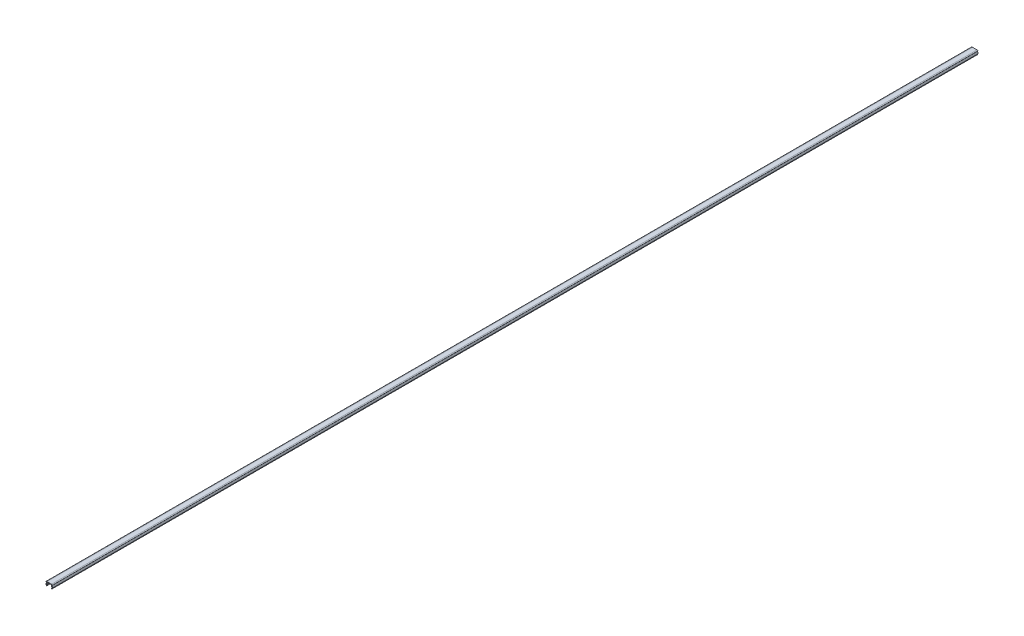
ISO-10303-21;
HEADER;
FILE_DESCRIPTION(('STEP AP214'),'2;1');
FILE_NAME('part.step','',(''),(''),'','','');
FILE_SCHEMA(('AUTOMOTIVE_DESIGN { 1 0 10303 214 1 1 1 1 }'));
ENDSEC;
DATA;
#1=APPLICATION_CONTEXT('core data for automotive mechanical design processes');
#2=APPLICATION_PROTOCOL_DEFINITION('international standard','automotive_design',2000,#1);
#3=PRODUCT_CONTEXT('',#1,'mechanical');
#4=PRODUCT('Part','Part','',(#3));
#5=PRODUCT_RELATED_PRODUCT_CATEGORY('part','',(#4));
#6=PRODUCT_DEFINITION_FORMATION('','',#4);
#7=PRODUCT_DEFINITION_CONTEXT('part definition',#1,'design');
#8=PRODUCT_DEFINITION('design','',#6,#7);
#9=PRODUCT_DEFINITION_SHAPE('','',#8);
#10=(LENGTH_UNIT() NAMED_UNIT(*) SI_UNIT(.MILLI.,.METRE.));
#11=(NAMED_UNIT(*) PLANE_ANGLE_UNIT() SI_UNIT($,.RADIAN.));
#12=(NAMED_UNIT(*) SI_UNIT($,.STERADIAN.) SOLID_ANGLE_UNIT());
#13=UNCERTAINTY_MEASURE_WITH_UNIT(LENGTH_MEASURE(1.E-05),#10,'distance_accuracy_value','');
#14=(GEOMETRIC_REPRESENTATION_CONTEXT(3) GLOBAL_UNCERTAINTY_ASSIGNED_CONTEXT((#13)) GLOBAL_UNIT_ASSIGNED_CONTEXT((#10,
#11,#12)) REPRESENTATION_CONTEXT('',''));
#15=CARTESIAN_POINT('',(0.,0.,0.));
#16=DIRECTION('',(0.,0.,1.));
#17=DIRECTION('',(1.,0.,0.));
#18=AXIS2_PLACEMENT_3D('',#15,#16,#17);
#19=CARTESIAN_POINT('',(0.,4.3,1000.));
#20=DIRECTION('',(0.,-1.,0.));
#21=DIRECTION('',(1.,0.,0.));
#22=AXIS2_PLACEMENT_3D('',#19,#20,#21);
#23=PLANE('',#22);
#24=DIRECTION('',(-1.,0.,0.));
#25=VECTOR('',#24,1.);
#26=CARTESIAN_POINT('',(0.,4.3,1000.));
#27=LINE('',#26,#25);
#28=CARTESIAN_POINT('',(2.5,4.3,1000.));
#29=VERTEX_POINT('',#28);
#30=CARTESIAN_POINT('',(-2.5,4.3,1000.));
#31=VERTEX_POINT('',#30);
#32=EDGE_CURVE('E242',#29,#31,#27,.T.);
#33=ORIENTED_EDGE('',*,*,#32,.F.);
#34=CARTESIAN_POINT('',(2.5,4.3,-50.));
#35=CARTESIAN_POINT('',(2.5,4.3,316.666666666667));
#36=CARTESIAN_POINT('',(2.5,4.3,683.333333333333));
#37=CARTESIAN_POINT('',(2.5,4.3,1050.));
#38=(BOUNDED_CURVE() B_SPLINE_CURVE(3,(#34,#35,#36,#37),.UNSPECIFIED.,.F.,
.F.) B_SPLINE_CURVE_WITH_KNOTS((4,4),(-1.05,0.05),
.UNSPECIFIED.) CURVE() GEOMETRIC_REPRESENTATION_ITEM() RATIONAL_B_SPLINE_CURVE((1.,1.,1.,1.)) REPRESENTATION_ITEM(''));
#39=CARTESIAN_POINT('',(2.5,4.3,0.));
#40=VERTEX_POINT('',#39);
#41=EDGE_CURVE('E249',#29,#40,#38,.F.);
#42=ORIENTED_EDGE('',*,*,#41,.T.);
#43=DIRECTION('',(-1.,0.,0.));
#44=VECTOR('',#43,1.);
#45=CARTESIAN_POINT('',(0.,4.3,0.));
#46=LINE('',#45,#44);
#47=CARTESIAN_POINT('',(-2.5,4.3,0.));
#48=VERTEX_POINT('',#47);
#49=EDGE_CURVE('E196',#40,#48,#46,.T.);
#50=ORIENTED_EDGE('',*,*,#49,.T.);
#51=CARTESIAN_POINT('',(-2.5,4.3,1050.));
#52=CARTESIAN_POINT('',(-2.5,4.3,683.333333333334));
#53=CARTESIAN_POINT('',(-2.5,4.3,316.666666666666));
#54=CARTESIAN_POINT('',(-2.5,4.3,-49.9999999999998));
#55=(BOUNDED_CURVE() B_SPLINE_CURVE(3,(#51,#52,#53,#54),.UNSPECIFIED.,.F.,
.F.) B_SPLINE_CURVE_WITH_KNOTS((4,4),(-0.05,1.05),
.UNSPECIFIED.) CURVE() GEOMETRIC_REPRESENTATION_ITEM() RATIONAL_B_SPLINE_CURVE((1.,1.,1.,1.)) REPRESENTATION_ITEM(''));
#56=EDGE_CURVE('E368',#48,#31,#55,.F.);
#57=ORIENTED_EDGE('',*,*,#56,.T.);
#58=EDGE_LOOP('',(#33,#42,#50,#57));
#59=FACE_BOUND('',#58,.T.);
#60=ADVANCED_FACE('F20',(#59),#23,.F.);
#61=CARTESIAN_POINT('',(-3.,3.7,1000.));
#62=DIRECTION('',(0.,1.,0.));
#63=DIRECTION('',(-1.,0.,0.));
#64=AXIS2_PLACEMENT_3D('',#61,#62,#63);
#65=PLANE('',#64);
#66=DIRECTION('',(1.,0.,0.));
#67=VECTOR('',#66,1.);
#68=CARTESIAN_POINT('',(-3.,3.7,1000.));
#69=LINE('',#68,#67);
#70=CARTESIAN_POINT('',(-3.3,3.7,1000.));
#71=VERTEX_POINT('',#70);
#72=CARTESIAN_POINT('',(-3.,3.7,1000.));
#73=VERTEX_POINT('',#72);
#74=EDGE_CURVE('E239',#71,#73,#69,.T.);
#75=ORIENTED_EDGE('',*,*,#74,.F.);
#76=DIRECTION('',(0.,0.,-1.));
#77=VECTOR('',#76,1.);
#78=CARTESIAN_POINT('',(-3.3,3.7,1000.));
#79=LINE('',#78,#77);
#80=CARTESIAN_POINT('',(-3.3,3.7,0.));
#81=VERTEX_POINT('',#80);
#82=EDGE_CURVE('E409',#71,#81,#79,.T.);
#83=ORIENTED_EDGE('',*,*,#82,.T.);
#84=DIRECTION('',(1.,0.,0.));
#85=VECTOR('',#84,1.);
#86=CARTESIAN_POINT('',(-3.,3.7,0.));
#87=LINE('',#86,#85);
#88=CARTESIAN_POINT('',(-3.,3.7,0.));
#89=VERTEX_POINT('',#88);
#90=EDGE_CURVE('E462',#81,#89,#87,.T.);
#91=ORIENTED_EDGE('',*,*,#90,.T.);
#92=DIRECTION('',(0.,0.,-1.));
#93=VECTOR('',#92,1.);
#94=CARTESIAN_POINT('',(-3.,3.7,1000.));
#95=LINE('',#94,#93);
#96=EDGE_CURVE('E455',#73,#89,#95,.T.);
#97=ORIENTED_EDGE('',*,*,#96,.F.);
#98=EDGE_LOOP('',(#75,#83,#91,#97));
#99=FACE_BOUND('',#98,.T.);
#100=ADVANCED_FACE('F265',(#99),#65,.F.);
#101=CARTESIAN_POINT('',(-3.,3.7,1000.));
#102=DIRECTION('',(0.982006446980647,-0.188847393650125,0.));
#103=DIRECTION('',(0.188847393650125,0.982006446980647,0.));
#104=AXIS2_PLACEMENT_3D('',#101,#102,#103);
#105=PLANE('',#104);
#106=DIRECTION('',(-0.188847393650125,-0.982006446980647,0.));
#107=VECTOR('',#106,1.);
#108=CARTESIAN_POINT('',(-3.,3.7,0.));
#109=LINE('',#108,#107);
#110=CARTESIAN_POINT('',(-3.48570370767357,1.17434072009741,0.));
#111=VERTEX_POINT('',#110);
#112=EDGE_CURVE('E465',#89,#111,#109,.T.);
#113=ORIENTED_EDGE('',*,*,#112,.T.);
#114=DIRECTION('',(0.,0.,-1.));
#115=VECTOR('',#114,1.);
#116=CARTESIAN_POINT('',(-3.48570370767357,1.17434072009741,1000.));
#117=LINE('',#116,#115);
#118=CARTESIAN_POINT('',(-3.48570370767357,1.17434072009741,1000.));
#119=VERTEX_POINT('',#118);
#120=EDGE_CURVE('E372',#111,#119,#117,.F.);
#121=ORIENTED_EDGE('',*,*,#120,.T.);
#122=DIRECTION('',(-0.188847393650125,-0.982006446980647,0.));
#123=VECTOR('',#122,1.);
#124=CARTESIAN_POINT('',(-3.,3.7,1000.));
#125=LINE('',#124,#123);
#126=EDGE_CURVE('E477',#73,#119,#125,.T.);
#127=ORIENTED_EDGE('',*,*,#126,.F.);
#128=ORIENTED_EDGE('',*,*,#96,.T.);
#129=EDGE_LOOP('',(#113,#121,#127,#128));
#130=FACE_BOUND('',#129,.T.);
#131=ADVANCED_FACE('F474',(#130),#105,.F.);
#132=CARTESIAN_POINT('',(-3.5,1.1,1000.));
#133=DIRECTION('',(0.860926528214315,0.508729312126642,0.));
#134=DIRECTION('',(-0.508729312126642,0.860926528214315,0.));
#135=AXIS2_PLACEMENT_3D('',#132,#133,#134);
#136=PLANE('',#135);
#137=DIRECTION('',(0.508729312126642,-0.860926528214315,0.));
#138=VECTOR('',#137,1.);
#139=CARTESIAN_POINT('',(-3.5,1.1,1000.));
#140=LINE('',#139,#138);
#141=CARTESIAN_POINT('',(-3.46148772392031,1.03482537894206,1000.));
#142=VERTEX_POINT('',#141);
#143=CARTESIAN_POINT('',(-2.85,0.,1000.));
#144=VERTEX_POINT('',#143);
#145=EDGE_CURVE('E430',#142,#144,#140,.T.);
#146=ORIENTED_EDGE('',*,*,#145,.F.);
#147=DIRECTION('',(0.,0.,-1.));
#148=VECTOR('',#147,1.);
#149=CARTESIAN_POINT('',(-3.46148772392031,1.03482537894206,1000.));
#150=LINE('',#149,#148);
#151=CARTESIAN_POINT('',(-3.46148772392031,1.03482537894206,0.));
#152=VERTEX_POINT('',#151);
#153=EDGE_CURVE('E376',#142,#152,#150,.T.);
#154=ORIENTED_EDGE('',*,*,#153,.T.);
#155=DIRECTION('',(0.508729312126642,-0.860926528214315,0.));
#156=VECTOR('',#155,1.);
#157=CARTESIAN_POINT('',(-3.5,1.1,0.));
#158=LINE('',#157,#156);
#159=CARTESIAN_POINT('',(-2.85,0.,0.));
#160=VERTEX_POINT('',#159);
#161=EDGE_CURVE('E445',#152,#160,#158,.T.);
#162=ORIENTED_EDGE('',*,*,#161,.T.);
#163=DIRECTION('',(0.,0.,-1.));
#164=VECTOR('',#163,1.);
#165=CARTESIAN_POINT('',(-2.85,0.,1000.));
#166=LINE('',#165,#164);
#167=EDGE_CURVE('E453',#144,#160,#166,.T.);
#168=ORIENTED_EDGE('',*,*,#167,.F.);
#169=EDGE_LOOP('',(#146,#154,#162,#168));
#170=FACE_BOUND('',#169,.T.);
#171=ADVANCED_FACE('F471',(#170),#136,.F.);
#172=CARTESIAN_POINT('',(-2.55,0.4,1000.));
#173=DIRECTION('',(-0.8,0.6,0.));
#174=DIRECTION('',(-0.6,-0.8,0.));
#175=AXIS2_PLACEMENT_3D('',#172,#173,#174);
#176=PLANE('',#175);
#177=DIRECTION('',(0.6,0.8,0.));
#178=VECTOR('',#177,1.);
#179=CARTESIAN_POINT('',(-2.55,0.4,0.));
#180=LINE('',#179,#178);
#181=CARTESIAN_POINT('',(-2.61693620586996,0.310751725506714,0.));
#182=VERTEX_POINT('',#181);
#183=EDGE_CURVE('E425',#160,#182,#180,.T.);
#184=ORIENTED_EDGE('',*,*,#183,.T.);
#185=DIRECTION('',(0.,0.,-1.));
#186=VECTOR('',#185,1.);
#187=CARTESIAN_POINT('',(-2.61693620586996,0.310751725506714,1000.));
#188=LINE('',#187,#186);
#189=CARTESIAN_POINT('',(-2.61693620586996,0.310751725506714,1000.));
#190=VERTEX_POINT('',#189);
#191=EDGE_CURVE('E384',#182,#190,#188,.F.);
#192=ORIENTED_EDGE('',*,*,#191,.T.);
#193=DIRECTION('',(0.6,0.8,0.));
#194=VECTOR('',#193,1.);
#195=CARTESIAN_POINT('',(-2.55,0.4,1000.));
#196=LINE('',#195,#194);
#197=EDGE_CURVE('E424',#144,#190,#196,.T.);
#198=ORIENTED_EDGE('',*,*,#197,.F.);
#199=ORIENTED_EDGE('',*,*,#167,.T.);
#200=EDGE_LOOP('',(#184,#192,#198,#199));
#201=FACE_BOUND('',#200,.T.);
#202=ADVANCED_FACE('F422',(#201),#176,.F.);
#203=CARTESIAN_POINT('',(-2.86790725483233,1.20971372410216,1000.));
#204=DIRECTION('',(-0.930827594429854,-0.365458601551435,0.));
#205=DIRECTION('',(0.365458601551435,-0.930827594429854,0.));
#206=AXIS2_PLACEMENT_3D('',#203,#204,#205);
#207=PLANE('',#206);
#208=DIRECTION('',(-0.365458601551435,0.930827594429854,0.));
#209=VECTOR('',#208,1.);
#210=CARTESIAN_POINT('',(-2.86790725483233,1.20971372410216,1000.));
#211=LINE('',#210,#209);
#212=CARTESIAN_POINT('',(-2.59077068698399,0.503843445817001,1000.));
#213=VERTEX_POINT('',#212);
#214=CARTESIAN_POINT('',(-2.86790725483233,1.20971372410216,1000.));
#215=VERTEX_POINT('',#214);
#216=EDGE_CURVE('E432',#213,#215,#211,.T.);
#217=ORIENTED_EDGE('',*,*,#216,.F.);
#218=DIRECTION('',(0.,0.,-1.));
#219=VECTOR('',#218,1.);
#220=CARTESIAN_POINT('',(-2.59077068698399,0.503843445817001,1000.));
#221=LINE('',#220,#219);
#222=CARTESIAN_POINT('',(-2.59077068698399,0.503843445817001,0.));
#223=VERTEX_POINT('',#222);
#224=EDGE_CURVE('E416',#213,#223,#221,.T.);
#225=ORIENTED_EDGE('',*,*,#224,.T.);
#226=DIRECTION('',(-0.365458601551435,0.930827594429854,0.));
#227=VECTOR('',#226,1.);
#228=CARTESIAN_POINT('',(-2.86790725483233,1.20971372410216,0.));
#229=LINE('',#228,#227);
#230=CARTESIAN_POINT('',(-2.86790725483233,1.20971372410216,0.));
#231=VERTEX_POINT('',#230);
#232=EDGE_CURVE('E439',#223,#231,#229,.T.);
#233=ORIENTED_EDGE('',*,*,#232,.T.);
#234=DIRECTION('',(0.,0.,-1.));
#235=VECTOR('',#234,1.);
#236=CARTESIAN_POINT('',(-2.86790725483233,1.20971372410216,1000.));
#237=LINE('',#236,#235);
#238=EDGE_CURVE('E451',#215,#231,#237,.T.);
#239=ORIENTED_EDGE('',*,*,#238,.F.);
#240=EDGE_LOOP('',(#217,#225,#233,#239));
#241=FACE_BOUND('',#240,.T.);
#242=ADVANCED_FACE('F437',(#241),#207,.F.);
#243=CARTESIAN_POINT('',(-2.38900604792891,3.7,1000.));
#244=DIRECTION('',(-0.982006446980648,0.188847393650124,0.));
#245=DIRECTION('',(-0.188847393650124,-0.982006446980647,0.));
#246=AXIS2_PLACEMENT_3D('',#243,#244,#245);
#247=PLANE('',#246);
#248=DIRECTION('',(0.188847393650124,0.982006446980647,0.));
#249=VECTOR('',#248,1.);
#250=CARTESIAN_POINT('',(-2.38900604792891,3.7,0.));
#251=LINE('',#250,#249);
#252=CARTESIAN_POINT('',(-2.38900604792891,3.7,0.));
#253=VERTEX_POINT('',#252);
#254=EDGE_CURVE('E442',#231,#253,#251,.T.);
#255=ORIENTED_EDGE('',*,*,#254,.T.);
#256=DIRECTION('',(0.,0.,-1.));
#257=VECTOR('',#256,1.);
#258=CARTESIAN_POINT('',(-2.38900604792891,3.7,1000.));
#259=LINE('',#258,#257);
#260=CARTESIAN_POINT('',(-2.38900604792891,3.7,1000.));
#261=VERTEX_POINT('',#260);
#262=EDGE_CURVE('E186',#261,#253,#259,.T.);
#263=ORIENTED_EDGE('',*,*,#262,.F.);
#264=DIRECTION('',(0.188847393650124,0.982006446980647,0.));
#265=VECTOR('',#264,1.);
#266=CARTESIAN_POINT('',(-2.38900604792891,3.7,1000.));
#267=LINE('',#266,#265);
#268=EDGE_CURVE('E182',#215,#261,#267,.T.);
#269=ORIENTED_EDGE('',*,*,#268,.F.);
#270=ORIENTED_EDGE('',*,*,#238,.T.);
#271=EDGE_LOOP('',(#255,#263,#269,#270));
#272=FACE_BOUND('',#271,.T.);
#273=ADVANCED_FACE('F482',(#272),#247,.F.);
#274=CARTESIAN_POINT('',(0.,3.7,1000.));
#275=DIRECTION('',(0.,1.,0.));
#276=DIRECTION('',(-1.,0.,0.));
#277=AXIS2_PLACEMENT_3D('',#274,#275,#276);
#278=PLANE('',#277);
#279=DIRECTION('',(1.,0.,0.));
#280=VECTOR('',#279,1.);
#281=CARTESIAN_POINT('',(0.,3.7,0.));
#282=LINE('',#281,#280);
#283=CARTESIAN_POINT('',(2.38900604792891,3.7,0.));
#284=VERTEX_POINT('',#283);
#285=EDGE_CURVE('E192',#253,#284,#282,.T.);
#286=ORIENTED_EDGE('',*,*,#285,.T.);
#287=DIRECTION('',(0.,0.,-1.));
#288=VECTOR('',#287,1.);
#289=CARTESIAN_POINT('',(2.38900604792891,3.7,1000.));
#290=LINE('',#289,#288);
#291=CARTESIAN_POINT('',(2.38900604792891,3.7,1000.));
#292=VERTEX_POINT('',#291);
#293=EDGE_CURVE('E189',#292,#284,#290,.T.);
#294=ORIENTED_EDGE('',*,*,#293,.F.);
#295=DIRECTION('',(1.,0.,0.));
#296=VECTOR('',#295,1.);
#297=CARTESIAN_POINT('',(0.,3.7,1000.));
#298=LINE('',#297,#296);
#299=EDGE_CURVE('E175',#261,#292,#298,.T.);
#300=ORIENTED_EDGE('',*,*,#299,.F.);
#301=ORIENTED_EDGE('',*,*,#262,.T.);
#302=EDGE_LOOP('',(#286,#294,#300,#301));
#303=FACE_BOUND('',#302,.T.);
#304=ADVANCED_FACE('F190',(#303),#278,.F.);
#305=CARTESIAN_POINT('',(0.,0.,1000.));
#306=DIRECTION('',(0.,0.,1.));
#307=DIRECTION('',(1.,0.,0.));
#308=AXIS2_PLACEMENT_3D('',#305,#306,#307);
#309=PLANE('',#308);
#310=CARTESIAN_POINT('',(3.3,3.9,1000.));
#311=DIRECTION('',(0.,0.,1.));
#312=DIRECTION('',(1.,0.,0.));
#313=AXIS2_PLACEMENT_3D('',#310,#311,#312);
#314=CIRCLE('',#313,0.2);
#315=CARTESIAN_POINT('',(3.3,3.7,1000.));
#316=VERTEX_POINT('',#315);
#317=CARTESIAN_POINT('',(3.5,3.9,1000.));
#318=VERTEX_POINT('',#317);
#319=EDGE_CURVE('E312',#316,#318,#314,.T.);
#320=ORIENTED_EDGE('',*,*,#319,.T.);
#321=CARTESIAN_POINT('',(2.5,4.3,1000.));
#322=CARTESIAN_POINT('',(3.5,4.3,1000.));
#323=CARTESIAN_POINT('',(3.5,3.9,1000.));
#324=(BOUNDED_CURVE() B_SPLINE_CURVE(2,(#321,#322,#323),.UNSPECIFIED.,.F.,
.F.) B_SPLINE_CURVE_WITH_KNOTS((3,3),(0.,1.),
.UNSPECIFIED.) CURVE() GEOMETRIC_REPRESENTATION_ITEM() RATIONAL_B_SPLINE_CURVE((1.,
0.707106781186548,1.)) REPRESENTATION_ITEM(''));
#325=EDGE_CURVE('E11',#318,#29,#324,.F.);
#326=ORIENTED_EDGE('',*,*,#325,.T.);
#327=ORIENTED_EDGE('',*,*,#32,.T.);
#328=CARTESIAN_POINT('',(-3.5,3.9,1000.));
#329=CARTESIAN_POINT('',(-3.5,4.3,1000.));
#330=CARTESIAN_POINT('',(-2.5,4.3,1000.));
#331=(BOUNDED_CURVE() B_SPLINE_CURVE(2,(#328,#329,#330),.UNSPECIFIED.,.F.,
.F.) B_SPLINE_CURVE_WITH_KNOTS((3,3),(0.,1.),
.UNSPECIFIED.) CURVE() GEOMETRIC_REPRESENTATION_ITEM() RATIONAL_B_SPLINE_CURVE((1.,
0.707106781186548,1.)) REPRESENTATION_ITEM(''));
#332=CARTESIAN_POINT('',(-3.5,3.9,1000.));
#333=VERTEX_POINT('',#332);
#334=EDGE_CURVE('E285',#31,#333,#331,.F.);
#335=ORIENTED_EDGE('',*,*,#334,.T.);
#336=CARTESIAN_POINT('',(-3.3,3.9,1000.));
#337=DIRECTION('',(0.,0.,1.));
#338=DIRECTION('',(1.,0.,0.));
#339=AXIS2_PLACEMENT_3D('',#336,#337,#338);
#340=CIRCLE('',#339,0.2);
#341=EDGE_CURVE('E291',#333,#71,#340,.T.);
#342=ORIENTED_EDGE('',*,*,#341,.T.);
#343=ORIENTED_EDGE('',*,*,#74,.T.);
#344=ORIENTED_EDGE('',*,*,#126,.T.);
#345=CARTESIAN_POINT('',(-3.28930241827745,1.13657124136739,1000.));
#346=DIRECTION('',(0.,0.,1.));
#347=DIRECTION('',(1.,0.,0.));
#348=AXIS2_PLACEMENT_3D('',#345,#346,#347);
#349=CIRCLE('',#348,0.2);
#350=EDGE_CURVE('E403',#119,#142,#349,.T.);
#351=ORIENTED_EDGE('',*,*,#350,.T.);
#352=ORIENTED_EDGE('',*,*,#145,.T.);
#353=ORIENTED_EDGE('',*,*,#197,.T.);
#354=CARTESIAN_POINT('',(-2.77693620586996,0.430751725506714,1000.));
#355=DIRECTION('',(0.,0.,1.));
#356=DIRECTION('',(1.,0.,0.));
#357=AXIS2_PLACEMENT_3D('',#354,#355,#356);
#358=CIRCLE('',#357,0.2);
#359=EDGE_CURVE('E414',#190,#213,#358,.T.);
#360=ORIENTED_EDGE('',*,*,#359,.T.);
#361=ORIENTED_EDGE('',*,*,#216,.T.);
#362=ORIENTED_EDGE('',*,*,#268,.T.);
#363=ORIENTED_EDGE('',*,*,#299,.T.);
#364=DIRECTION('',(-0.188847393650124,0.982006446980647,0.));
#365=VECTOR('',#364,1.);
#366=CARTESIAN_POINT('',(2.38900604792891,3.7,1000.));
#367=LINE('',#366,#365);
#368=CARTESIAN_POINT('',(2.86790725483233,1.20971372410216,1000.));
#369=VERTEX_POINT('',#368);
#370=EDGE_CURVE('E180',#369,#292,#367,.T.);
#371=ORIENTED_EDGE('',*,*,#370,.F.);
#372=DIRECTION('',(0.365458601551435,0.930827594429854,0.));
#373=VECTOR('',#372,1.);
#374=CARTESIAN_POINT('',(2.86790725483233,1.20971372410216,1000.));
#375=LINE('',#374,#373);
#376=CARTESIAN_POINT('',(2.59077068698399,0.503843445817001,1000.));
#377=VERTEX_POINT('',#376);
#378=EDGE_CURVE('E202',#377,#369,#375,.T.);
#379=ORIENTED_EDGE('',*,*,#378,.F.);
#380=CARTESIAN_POINT('',(2.77693620586996,0.430751725506714,1000.));
#381=DIRECTION('',(0.,0.,1.));
#382=DIRECTION('',(1.,0.,0.));
#383=AXIS2_PLACEMENT_3D('',#380,#381,#382);
#384=CIRCLE('',#383,0.2);
#385=CARTESIAN_POINT('',(2.61693620586996,0.310751725506714,1000.));
#386=VERTEX_POINT('',#385);
#387=EDGE_CURVE('E320',#377,#386,#384,.T.);
#388=ORIENTED_EDGE('',*,*,#387,.T.);
#389=DIRECTION('',(-0.6,0.8,0.));
#390=VECTOR('',#389,1.);
#391=CARTESIAN_POINT('',(2.55,0.4,1000.));
#392=LINE('',#391,#390);
#393=CARTESIAN_POINT('',(2.85,0.,1000.));
#394=VERTEX_POINT('',#393);
#395=EDGE_CURVE('E205',#394,#386,#392,.T.);
#396=ORIENTED_EDGE('',*,*,#395,.F.);
#397=DIRECTION('',(-0.508729312126642,-0.860926528214315,0.));
#398=VECTOR('',#397,1.);
#399=CARTESIAN_POINT('',(3.5,1.1,1000.));
#400=LINE('',#399,#398);
#401=CARTESIAN_POINT('',(3.46148772392031,1.03482537894206,1000.));
#402=VERTEX_POINT('',#401);
#403=EDGE_CURVE('E212',#402,#394,#400,.T.);
#404=ORIENTED_EDGE('',*,*,#403,.F.);
#405=CARTESIAN_POINT('',(3.28930241827745,1.13657124136739,1000.));
#406=DIRECTION('',(0.,0.,1.));
#407=DIRECTION('',(1.,0.,0.));
#408=AXIS2_PLACEMENT_3D('',#405,#406,#407);
#409=CIRCLE('',#408,0.2);
#410=CARTESIAN_POINT('',(3.48570370767357,1.17434072009741,1000.));
#411=VERTEX_POINT('',#410);
#412=EDGE_CURVE('E494',#402,#411,#409,.T.);
#413=ORIENTED_EDGE('',*,*,#412,.T.);
#414=DIRECTION('',(0.188847393650125,-0.982006446980647,0.));
#415=VECTOR('',#414,1.);
#416=CARTESIAN_POINT('',(3.,3.7,1000.));
#417=LINE('',#416,#415);
#418=CARTESIAN_POINT('',(3.,3.7,1000.));
#419=VERTEX_POINT('',#418);
#420=EDGE_CURVE('E214',#419,#411,#417,.T.);
#421=ORIENTED_EDGE('',*,*,#420,.F.);
#422=DIRECTION('',(-1.,0.,0.));
#423=VECTOR('',#422,1.);
#424=CARTESIAN_POINT('',(3.,3.7,1000.));
#425=LINE('',#424,#423);
#426=EDGE_CURVE('E217',#316,#419,#425,.T.);
#427=ORIENTED_EDGE('',*,*,#426,.F.);
#428=EDGE_LOOP('',(#320,#326,#327,#335,#342,#343,#344,#351,#352,#353,#360,#361,#362,#363,#371,
#379,#388,#396,#404,#413,#421,#427));
#429=FACE_BOUND('',#428,.T.);
#430=ADVANCED_FACE('F177',(#429),#309,.T.);
#431=CARTESIAN_POINT('',(0.,0.,0.));
#432=DIRECTION('',(0.,0.,1.));
#433=DIRECTION('',(1.,0.,0.));
#434=AXIS2_PLACEMENT_3D('',#431,#432,#433);
#435=PLANE('',#434);
#436=ORIENTED_EDGE('',*,*,#49,.F.);
#437=CARTESIAN_POINT('',(3.5,3.9,0.));
#438=CARTESIAN_POINT('',(3.5,4.3,0.));
#439=CARTESIAN_POINT('',(2.5,4.3,0.));
#440=(BOUNDED_CURVE() B_SPLINE_CURVE(2,(#437,#438,#439),.UNSPECIFIED.,.F.,
.F.) B_SPLINE_CURVE_WITH_KNOTS((3,3),(0.,1.),
.UNSPECIFIED.) CURVE() GEOMETRIC_REPRESENTATION_ITEM() RATIONAL_B_SPLINE_CURVE((1.,
0.707106781186548,1.)) REPRESENTATION_ITEM(''));
#441=CARTESIAN_POINT('',(3.5,3.9,0.));
#442=VERTEX_POINT('',#441);
#443=EDGE_CURVE('E35',#40,#442,#440,.F.);
#444=ORIENTED_EDGE('',*,*,#443,.T.);
#445=CARTESIAN_POINT('',(3.3,3.9,0.));
#446=DIRECTION('',(0.,0.,1.));
#447=DIRECTION('',(1.,0.,0.));
#448=AXIS2_PLACEMENT_3D('',#445,#446,#447);
#449=CIRCLE('',#448,0.2);
#450=CARTESIAN_POINT('',(3.3,3.7,0.));
#451=VERTEX_POINT('',#450);
#452=EDGE_CURVE('E364',#442,#451,#449,.F.);
#453=ORIENTED_EDGE('',*,*,#452,.T.);
#454=DIRECTION('',(-1.,0.,0.));
#455=VECTOR('',#454,1.);
#456=CARTESIAN_POINT('',(3.,3.7,0.));
#457=LINE('',#456,#455);
#458=CARTESIAN_POINT('',(3.,3.7,0.));
#459=VERTEX_POINT('',#458);
#460=EDGE_CURVE('E203',#451,#459,#457,.T.);
#461=ORIENTED_EDGE('',*,*,#460,.T.);
#462=DIRECTION('',(0.188847393650125,-0.982006446980647,0.));
#463=VECTOR('',#462,1.);
#464=CARTESIAN_POINT('',(3.,3.7,0.));
#465=LINE('',#464,#463);
#466=CARTESIAN_POINT('',(3.48570370767357,1.17434072009741,0.));
#467=VERTEX_POINT('',#466);
#468=EDGE_CURVE('E207',#459,#467,#465,.T.);
#469=ORIENTED_EDGE('',*,*,#468,.T.);
#470=CARTESIAN_POINT('',(3.28930241827745,1.13657124136739,0.));
#471=DIRECTION('',(0.,0.,1.));
#472=DIRECTION('',(1.,0.,0.));
#473=AXIS2_PLACEMENT_3D('',#470,#471,#472);
#474=CIRCLE('',#473,0.2);
#475=CARTESIAN_POINT('',(3.46148772392031,1.03482537894206,0.));
#476=VERTEX_POINT('',#475);
#477=EDGE_CURVE('E365',#467,#476,#474,.F.);
#478=ORIENTED_EDGE('',*,*,#477,.T.);
#479=DIRECTION('',(-0.508729312126642,-0.860926528214315,0.));
#480=VECTOR('',#479,1.);
#481=CARTESIAN_POINT('',(3.5,1.1,0.));
#482=LINE('',#481,#480);
#483=CARTESIAN_POINT('',(2.85,0.,0.));
#484=VERTEX_POINT('',#483);
#485=EDGE_CURVE('E227',#476,#484,#482,.T.);
#486=ORIENTED_EDGE('',*,*,#485,.T.);
#487=DIRECTION('',(-0.6,0.8,0.));
#488=VECTOR('',#487,1.);
#489=CARTESIAN_POINT('',(2.55,0.4,0.));
#490=LINE('',#489,#488);
#491=CARTESIAN_POINT('',(2.61693620586996,0.310751725506714,0.));
#492=VERTEX_POINT('',#491);
#493=EDGE_CURVE('E224',#484,#492,#490,.T.);
#494=ORIENTED_EDGE('',*,*,#493,.T.);
#495=CARTESIAN_POINT('',(2.77693620586996,0.430751725506714,0.));
#496=DIRECTION('',(0.,0.,1.));
#497=DIRECTION('',(1.,0.,0.));
#498=AXIS2_PLACEMENT_3D('',#495,#496,#497);
#499=CIRCLE('',#498,0.2);
#500=CARTESIAN_POINT('',(2.59077068698399,0.503843445817001,0.));
#501=VERTEX_POINT('',#500);
#502=EDGE_CURVE('E366',#492,#501,#499,.F.);
#503=ORIENTED_EDGE('',*,*,#502,.T.);
#504=DIRECTION('',(0.365458601551435,0.930827594429854,0.));
#505=VECTOR('',#504,1.);
#506=CARTESIAN_POINT('',(2.86790725483233,1.20971372410216,0.));
#507=LINE('',#506,#505);
#508=CARTESIAN_POINT('',(2.86790725483233,1.20971372410216,0.));
#509=VERTEX_POINT('',#508);
#510=EDGE_CURVE('E222',#501,#509,#507,.T.);
#511=ORIENTED_EDGE('',*,*,#510,.T.);
#512=DIRECTION('',(-0.188847393650124,0.982006446980647,0.));
#513=VECTOR('',#512,1.);
#514=CARTESIAN_POINT('',(2.38900604792891,3.7,0.));
#515=LINE('',#514,#513);
#516=EDGE_CURVE('E220',#509,#284,#515,.T.);
#517=ORIENTED_EDGE('',*,*,#516,.T.);
#518=ORIENTED_EDGE('',*,*,#285,.F.);
#519=ORIENTED_EDGE('',*,*,#254,.F.);
#520=ORIENTED_EDGE('',*,*,#232,.F.);
#521=CARTESIAN_POINT('',(-2.77693620586996,0.430751725506714,0.));
#522=DIRECTION('',(0.,0.,1.));
#523=DIRECTION('',(1.,0.,0.));
#524=AXIS2_PLACEMENT_3D('',#521,#522,#523);
#525=CIRCLE('',#524,0.2);
#526=EDGE_CURVE('E398',#223,#182,#525,.F.);
#527=ORIENTED_EDGE('',*,*,#526,.T.);
#528=ORIENTED_EDGE('',*,*,#183,.F.);
#529=ORIENTED_EDGE('',*,*,#161,.F.);
#530=CARTESIAN_POINT('',(-3.28930241827745,1.13657124136739,0.));
#531=DIRECTION('',(0.,0.,1.));
#532=DIRECTION('',(1.,0.,0.));
#533=AXIS2_PLACEMENT_3D('',#530,#531,#532);
#534=CIRCLE('',#533,0.2);
#535=EDGE_CURVE('E404',#152,#111,#534,.F.);
#536=ORIENTED_EDGE('',*,*,#535,.T.);
#537=ORIENTED_EDGE('',*,*,#112,.F.);
#538=ORIENTED_EDGE('',*,*,#90,.F.);
#539=CARTESIAN_POINT('',(-3.3,3.9,0.));
#540=DIRECTION('',(0.,0.,1.));
#541=DIRECTION('',(1.,0.,0.));
#542=AXIS2_PLACEMENT_3D('',#539,#540,#541);
#543=CIRCLE('',#542,0.2);
#544=CARTESIAN_POINT('',(-3.5,3.9,0.));
#545=VERTEX_POINT('',#544);
#546=EDGE_CURVE('E391',#81,#545,#543,.F.);
#547=ORIENTED_EDGE('',*,*,#546,.T.);
#548=CARTESIAN_POINT('',(-2.5,4.3,1.97758476261356E-13));
#549=CARTESIAN_POINT('',(-3.5,4.3,2.08527904668939E-13));
#550=CARTESIAN_POINT('',(-3.5,3.9,1.97758476261356E-13));
#551=(BOUNDED_CURVE() B_SPLINE_CURVE(2,(#548,#549,#550),.UNSPECIFIED.,.F.,
.F.) B_SPLINE_CURVE_WITH_KNOTS((3,3),(0.,1.),
.UNSPECIFIED.) CURVE() GEOMETRIC_REPRESENTATION_ITEM() RATIONAL_B_SPLINE_CURVE((1.,
0.707106781186548,1.)) REPRESENTATION_ITEM(''));
#552=EDGE_CURVE('E369',#545,#48,#551,.F.);
#553=ORIENTED_EDGE('',*,*,#552,.T.);
#554=EDGE_LOOP('',(#436,#444,#453,#461,#469,#478,#486,#494,#503,#511,#517,#518,#519,#520,#527,
#528,#529,#536,#537,#538,#547,#553));
#555=FACE_BOUND('',#554,.T.);
#556=ADVANCED_FACE('F302',(#555),#435,.F.);
#557=CARTESIAN_POINT('',(-3.3,3.9,1000.));
#558=DIRECTION('',(0.,0.,-1.));
#559=DIRECTION('',(-1.,0.,0.));
#560=AXIS2_PLACEMENT_3D('',#557,#558,#559);
#561=CYLINDRICAL_SURFACE('',#560,0.2);
#562=ORIENTED_EDGE('',*,*,#341,.F.);
#563=CARTESIAN_POINT('',(-3.5,3.9,-49.9999999999998));
#564=CARTESIAN_POINT('',(-3.5,3.9,316.666666666666));
#565=CARTESIAN_POINT('',(-3.5,3.9,683.333333333334));
#566=CARTESIAN_POINT('',(-3.5,3.9,1050.));
#567=(BOUNDED_CURVE() B_SPLINE_CURVE(3,(#563,#564,#565,#566),.UNSPECIFIED.,.F.,
.F.) B_SPLINE_CURVE_WITH_KNOTS((4,4),(-0.05,1.05),
.UNSPECIFIED.) CURVE() GEOMETRIC_REPRESENTATION_ITEM() RATIONAL_B_SPLINE_CURVE((1.,1.,1.,1.)) REPRESENTATION_ITEM(''));
#568=EDGE_CURVE('E397',#545,#333,#567,.T.);
#569=ORIENTED_EDGE('',*,*,#568,.F.);
#570=ORIENTED_EDGE('',*,*,#546,.F.);
#571=ORIENTED_EDGE('',*,*,#82,.F.);
#572=EDGE_LOOP('',(#562,#569,#570,#571));
#573=FACE_BOUND('',#572,.T.);
#574=ADVANCED_FACE('F267',(#573),#561,.T.);
#575=CARTESIAN_POINT('',(-2.77693620586996,0.430751725506714,1000.));
#576=DIRECTION('',(0.,0.,-1.));
#577=DIRECTION('',(-1.,0.,0.));
#578=AXIS2_PLACEMENT_3D('',#575,#576,#577);
#579=CYLINDRICAL_SURFACE('',#578,0.2);
#580=ORIENTED_EDGE('',*,*,#359,.F.);
#581=ORIENTED_EDGE('',*,*,#191,.F.);
#582=ORIENTED_EDGE('',*,*,#526,.F.);
#583=ORIENTED_EDGE('',*,*,#224,.F.);
#584=EDGE_LOOP('',(#580,#581,#582,#583));
#585=FACE_BOUND('',#584,.T.);
#586=ADVANCED_FACE('F435',(#585),#579,.T.);
#587=CARTESIAN_POINT('',(-3.28930241827745,1.13657124136739,1000.));
#588=DIRECTION('',(0.,0.,-1.));
#589=DIRECTION('',(-1.,0.,0.));
#590=AXIS2_PLACEMENT_3D('',#587,#588,#589);
#591=CYLINDRICAL_SURFACE('',#590,0.2);
#592=ORIENTED_EDGE('',*,*,#350,.F.);
#593=ORIENTED_EDGE('',*,*,#120,.F.);
#594=ORIENTED_EDGE('',*,*,#535,.F.);
#595=ORIENTED_EDGE('',*,*,#153,.F.);
#596=EDGE_LOOP('',(#592,#593,#594,#595));
#597=FACE_BOUND('',#596,.T.);
#598=ADVANCED_FACE('F476',(#597),#591,.T.);
#599=CARTESIAN_POINT('',(-3.5,3.9,1050.));
#600=CARTESIAN_POINT('',(-3.5,3.9,683.333333333334));
#601=CARTESIAN_POINT('',(-3.5,3.9,316.666666666666));
#602=CARTESIAN_POINT('',(-3.5,3.9,-49.9999999999998));
#603=CARTESIAN_POINT('',(-3.5,4.3,1050.));
#604=CARTESIAN_POINT('',(-3.5,4.3,683.333333333334));
#605=CARTESIAN_POINT('',(-3.5,4.3,316.666666666666));
#606=CARTESIAN_POINT('',(-3.5,4.3,-49.9999999999998));
#607=CARTESIAN_POINT('',(-2.5,4.3,1050.));
#608=CARTESIAN_POINT('',(-2.5,4.3,683.333333333334));
#609=CARTESIAN_POINT('',(-2.5,4.3,316.666666666666));
#610=CARTESIAN_POINT('',(-2.5,4.3,-49.9999999999998));
#611=(BOUNDED_SURFACE() B_SPLINE_SURFACE(2,3,((#599,#600,#601,#602),(#603,#604,#605,#606),(#607,
#608,#609,#610)),.UNSPECIFIED.,.F.,.F.,.F.) B_SPLINE_SURFACE_WITH_KNOTS((3,3),(4,4),(0.,1.),
(-0.05,1.05),.UNSPECIFIED.) GEOMETRIC_REPRESENTATION_ITEM() RATIONAL_B_SPLINE_SURFACE(((1.,1.,
1.,1.),(0.707106781186548,0.707106781186548,0.707106781186548,0.707106781186548),(1.,1.,1.,1.))) REPRESENTATION_ITEM('') SURFACE());
#612=ORIENTED_EDGE('',*,*,#334,.F.);
#613=ORIENTED_EDGE('',*,*,#56,.F.);
#614=ORIENTED_EDGE('',*,*,#552,.F.);
#615=ORIENTED_EDGE('',*,*,#568,.T.);
#616=EDGE_LOOP('',(#612,#613,#614,#615));
#617=FACE_BOUND('',#616,.T.);
#618=ADVANCED_FACE('F532',(#617),#611,.T.);
#619=CARTESIAN_POINT('',(2.38900604792891,3.7,1000.));
#620=DIRECTION('',(-0.982006446980647,-0.188847393650124,0.));
#621=DIRECTION('',(0.188847393650124,-0.982006446980647,0.));
#622=AXIS2_PLACEMENT_3D('',#619,#620,#621);
#623=PLANE('',#622);
#624=ORIENTED_EDGE('',*,*,#516,.F.);
#625=DIRECTION('',(0.,0.,-1.));
#626=VECTOR('',#625,1.);
#627=CARTESIAN_POINT('',(2.86790725483233,1.20971372410216,1000.));
#628=LINE('',#627,#626);
#629=EDGE_CURVE('E197',#369,#509,#628,.T.);
#630=ORIENTED_EDGE('',*,*,#629,.F.);
#631=ORIENTED_EDGE('',*,*,#370,.T.);
#632=ORIENTED_EDGE('',*,*,#293,.T.);
#633=EDGE_LOOP('',(#624,#630,#631,#632));
#634=FACE_BOUND('',#633,.T.);
#635=ADVANCED_FACE('F200',(#634),#623,.T.);
#636=CARTESIAN_POINT('',(2.86790725483233,1.20971372410216,1000.));
#637=DIRECTION('',(-0.930827594429854,0.365458601551435,0.));
#638=DIRECTION('',(-0.365458601551435,-0.930827594429854,0.));
#639=AXIS2_PLACEMENT_3D('',#636,#637,#638);
#640=PLANE('',#639);
#641=ORIENTED_EDGE('',*,*,#510,.F.);
#642=DIRECTION('',(0.,0.,-1.));
#643=VECTOR('',#642,1.);
#644=CARTESIAN_POINT('',(2.59077068698399,0.503843445817001,1000.));
#645=LINE('',#644,#643);
#646=EDGE_CURVE('E487',#501,#377,#645,.F.);
#647=ORIENTED_EDGE('',*,*,#646,.T.);
#648=ORIENTED_EDGE('',*,*,#378,.T.);
#649=ORIENTED_EDGE('',*,*,#629,.T.);
#650=EDGE_LOOP('',(#641,#647,#648,#649));
#651=FACE_BOUND('',#650,.T.);
#652=ADVANCED_FACE('F486',(#651),#640,.T.);
#653=CARTESIAN_POINT('',(2.55,0.4,1000.));
#654=DIRECTION('',(-0.8,-0.6,0.));
#655=DIRECTION('',(0.6,-0.8,0.));
#656=AXIS2_PLACEMENT_3D('',#653,#654,#655);
#657=PLANE('',#656);
#658=ORIENTED_EDGE('',*,*,#395,.T.);
#659=DIRECTION('',(0.,0.,-1.));
#660=VECTOR('',#659,1.);
#661=CARTESIAN_POINT('',(2.61693620586996,0.310751725506714,1000.));
#662=LINE('',#661,#660);
#663=EDGE_CURVE('E319',#386,#492,#662,.T.);
#664=ORIENTED_EDGE('',*,*,#663,.T.);
#665=ORIENTED_EDGE('',*,*,#493,.F.);
#666=DIRECTION('',(0.,0.,-1.));
#667=VECTOR('',#666,1.);
#668=CARTESIAN_POINT('',(2.85,0.,1000.));
#669=LINE('',#668,#667);
#670=EDGE_CURVE('E233',#394,#484,#669,.T.);
#671=ORIENTED_EDGE('',*,*,#670,.F.);
#672=EDGE_LOOP('',(#658,#664,#665,#671));
#673=FACE_BOUND('',#672,.T.);
#674=ADVANCED_FACE('F618',(#673),#657,.T.);
#675=CARTESIAN_POINT('',(3.5,1.1,1000.));
#676=DIRECTION('',(0.860926528214315,-0.508729312126642,0.));
#677=DIRECTION('',(0.508729312126642,0.860926528214315,0.));
#678=AXIS2_PLACEMENT_3D('',#675,#676,#677);
#679=PLANE('',#678);
#680=ORIENTED_EDGE('',*,*,#485,.F.);
#681=DIRECTION('',(0.,0.,-1.));
#682=VECTOR('',#681,1.);
#683=CARTESIAN_POINT('',(3.46148772392031,1.03482537894206,1000.));
#684=LINE('',#683,#682);
#685=EDGE_CURVE('E504',#476,#402,#684,.F.);
#686=ORIENTED_EDGE('',*,*,#685,.T.);
#687=ORIENTED_EDGE('',*,*,#403,.T.);
#688=ORIENTED_EDGE('',*,*,#670,.T.);
#689=EDGE_LOOP('',(#680,#686,#687,#688));
#690=FACE_BOUND('',#689,.T.);
#691=ADVANCED_FACE('F614',(#690),#679,.T.);
#692=CARTESIAN_POINT('',(3.,3.7,1000.));
#693=DIRECTION('',(0.982006446980647,0.188847393650125,0.));
#694=DIRECTION('',(-0.188847393650125,0.982006446980647,0.));
#695=AXIS2_PLACEMENT_3D('',#692,#693,#694);
#696=PLANE('',#695);
#697=ORIENTED_EDGE('',*,*,#420,.T.);
#698=DIRECTION('',(0.,0.,-1.));
#699=VECTOR('',#698,1.);
#700=CARTESIAN_POINT('',(3.48570370767357,1.17434072009741,1000.));
#701=LINE('',#700,#699);
#702=EDGE_CURVE('E502',#411,#467,#701,.T.);
#703=ORIENTED_EDGE('',*,*,#702,.T.);
#704=ORIENTED_EDGE('',*,*,#468,.F.);
#705=DIRECTION('',(0.,0.,-1.));
#706=VECTOR('',#705,1.);
#707=CARTESIAN_POINT('',(3.,3.7,1000.));
#708=LINE('',#707,#706);
#709=EDGE_CURVE('E219',#419,#459,#708,.T.);
#710=ORIENTED_EDGE('',*,*,#709,.F.);
#711=EDGE_LOOP('',(#697,#703,#704,#710));
#712=FACE_BOUND('',#711,.T.);
#713=ADVANCED_FACE('F613',(#712),#696,.T.);
#714=CARTESIAN_POINT('',(3.,3.7,1000.));
#715=DIRECTION('',(0.,-1.,0.));
#716=DIRECTION('',(1.,0.,0.));
#717=AXIS2_PLACEMENT_3D('',#714,#715,#716);
#718=PLANE('',#717);
#719=ORIENTED_EDGE('',*,*,#460,.F.);
#720=DIRECTION('',(0.,0.,-1.));
#721=VECTOR('',#720,1.);
#722=CARTESIAN_POINT('',(3.3,3.7,1000.));
#723=LINE('',#722,#721);
#724=EDGE_CURVE('E496',#451,#316,#723,.F.);
#725=ORIENTED_EDGE('',*,*,#724,.T.);
#726=ORIENTED_EDGE('',*,*,#426,.T.);
#727=ORIENTED_EDGE('',*,*,#709,.T.);
#728=EDGE_LOOP('',(#719,#725,#726,#727));
#729=FACE_BOUND('',#728,.T.);
#730=ADVANCED_FACE('F512',(#729),#718,.T.);
#731=CARTESIAN_POINT('',(3.3,3.9,1000.));
#732=DIRECTION('',(0.,0.,-1.));
#733=DIRECTION('',(-1.,0.,0.));
#734=AXIS2_PLACEMENT_3D('',#731,#732,#733);
#735=CYLINDRICAL_SURFACE('',#734,0.2);
#736=ORIENTED_EDGE('',*,*,#319,.F.);
#737=ORIENTED_EDGE('',*,*,#724,.F.);
#738=ORIENTED_EDGE('',*,*,#452,.F.);
#739=CARTESIAN_POINT('',(3.5,3.9,1050.));
#740=CARTESIAN_POINT('',(3.5,3.9,683.333333333333));
#741=CARTESIAN_POINT('',(3.5,3.9,316.666666666667));
#742=CARTESIAN_POINT('',(3.5,3.9,-50.));
#743=(BOUNDED_CURVE() B_SPLINE_CURVE(3,(#739,#740,#741,#742),.UNSPECIFIED.,.F.,
.F.) B_SPLINE_CURVE_WITH_KNOTS((4,4),(-1.05,0.05),
.UNSPECIFIED.) CURVE() GEOMETRIC_REPRESENTATION_ITEM() RATIONAL_B_SPLINE_CURVE((1.,1.,1.,1.)) REPRESENTATION_ITEM(''));
#744=EDGE_CURVE('E351',#318,#442,#743,.T.);
#745=ORIENTED_EDGE('',*,*,#744,.F.);
#746=EDGE_LOOP('',(#736,#737,#738,#745));
#747=FACE_BOUND('',#746,.T.);
#748=ADVANCED_FACE('F362',(#747),#735,.T.);
#749=CARTESIAN_POINT('',(2.77693620586996,0.430751725506714,1000.));
#750=DIRECTION('',(0.,0.,-1.));
#751=DIRECTION('',(-1.,0.,0.));
#752=AXIS2_PLACEMENT_3D('',#749,#750,#751);
#753=CYLINDRICAL_SURFACE('',#752,0.2);
#754=ORIENTED_EDGE('',*,*,#387,.F.);
#755=ORIENTED_EDGE('',*,*,#646,.F.);
#756=ORIENTED_EDGE('',*,*,#502,.F.);
#757=ORIENTED_EDGE('',*,*,#663,.F.);
#758=EDGE_LOOP('',(#754,#755,#756,#757));
#759=FACE_BOUND('',#758,.T.);
#760=ADVANCED_FACE('F492',(#759),#753,.T.);
#761=CARTESIAN_POINT('',(3.28930241827745,1.13657124136739,1000.));
#762=DIRECTION('',(0.,0.,-1.));
#763=DIRECTION('',(-1.,0.,0.));
#764=AXIS2_PLACEMENT_3D('',#761,#762,#763);
#765=CYLINDRICAL_SURFACE('',#764,0.2);
#766=ORIENTED_EDGE('',*,*,#412,.F.);
#767=ORIENTED_EDGE('',*,*,#685,.F.);
#768=ORIENTED_EDGE('',*,*,#477,.F.);
#769=ORIENTED_EDGE('',*,*,#702,.F.);
#770=EDGE_LOOP('',(#766,#767,#768,#769));
#771=FACE_BOUND('',#770,.T.);
#772=ADVANCED_FACE('F602',(#771),#765,.T.);
#773=CARTESIAN_POINT('',(3.5,3.9,-50.));
#774=CARTESIAN_POINT('',(3.5,3.9,316.666666666667));
#775=CARTESIAN_POINT('',(3.5,3.9,683.333333333333));
#776=CARTESIAN_POINT('',(3.5,3.9,1050.));
#777=CARTESIAN_POINT('',(3.5,4.3,-50.));
#778=CARTESIAN_POINT('',(3.5,4.3,316.666666666667));
#779=CARTESIAN_POINT('',(3.5,4.3,683.333333333333));
#780=CARTESIAN_POINT('',(3.5,4.3,1050.));
#781=CARTESIAN_POINT('',(2.5,4.3,-50.));
#782=CARTESIAN_POINT('',(2.5,4.3,316.666666666667));
#783=CARTESIAN_POINT('',(2.5,4.3,683.333333333333));
#784=CARTESIAN_POINT('',(2.5,4.3,1050.));
#785=(BOUNDED_SURFACE() B_SPLINE_SURFACE(2,3,((#773,#774,#775,#776),(#777,#778,#779,#780),(#781,
#782,#783,#784)),.UNSPECIFIED.,.F.,.F.,.F.) B_SPLINE_SURFACE_WITH_KNOTS((3,3),(4,4),(0.,1.),
(-1.05,0.05),.UNSPECIFIED.) GEOMETRIC_REPRESENTATION_ITEM() RATIONAL_B_SPLINE_SURFACE(((1.,1.,
1.,1.),(0.707106781186548,0.707106781186548,0.707106781186548,0.707106781186548),(1.,1.,1.,1.))) REPRESENTATION_ITEM('') SURFACE());
#786=ORIENTED_EDGE('',*,*,#325,.F.);
#787=ORIENTED_EDGE('',*,*,#744,.T.);
#788=ORIENTED_EDGE('',*,*,#443,.F.);
#789=ORIENTED_EDGE('',*,*,#41,.F.);
#790=EDGE_LOOP('',(#786,#787,#788,#789));
#791=FACE_BOUND('',#790,.T.);
#792=ADVANCED_FACE('F23',(#791),#785,.T.);
#793=CLOSED_SHELL('',(#60,#100,#131,#171,#202,#242,#273,#304,#430,#556,#574,#586,#598,#618,#635,
#652,#674,#691,#713,#730,#748,#760,#772,#792));
#794=MANIFOLD_SOLID_BREP('B1',#793);
#795=ADVANCED_BREP_SHAPE_REPRESENTATION('',(#18,#794),#14);
#796=SHAPE_DEFINITION_REPRESENTATION(#9,#795);
ENDSEC;
END-ISO-10303-21;
